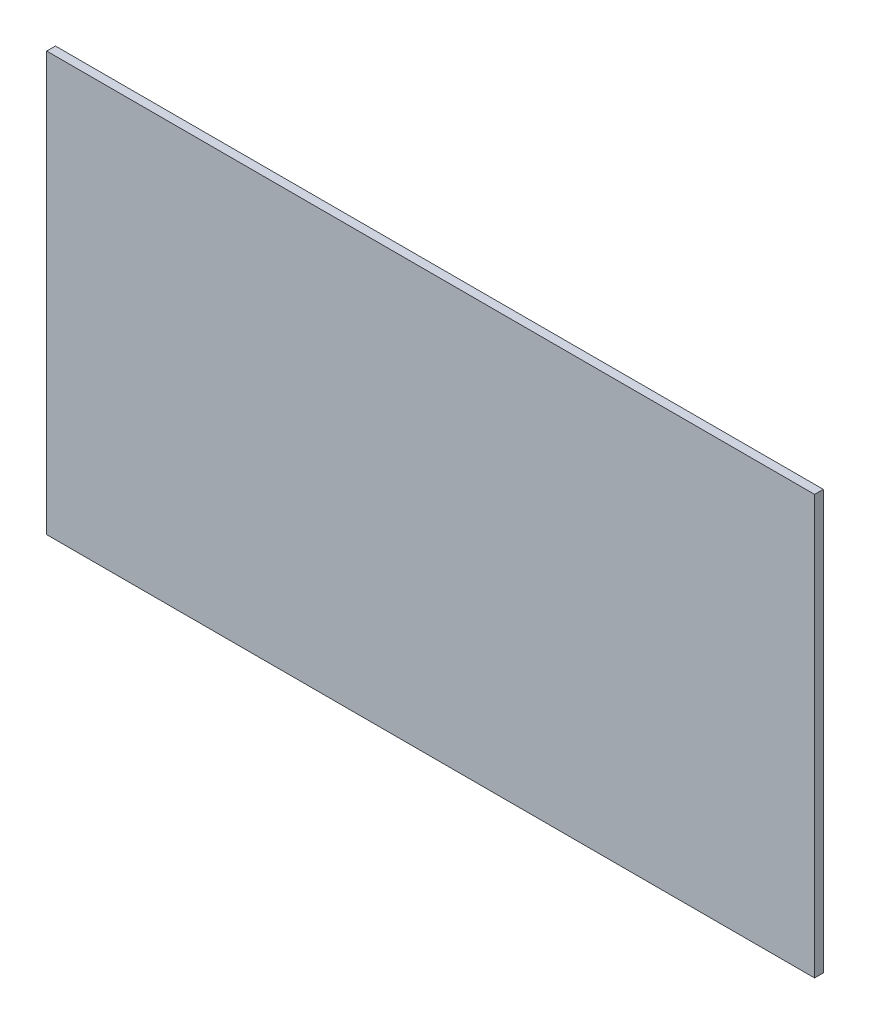
ISO-10303-21;
HEADER;
FILE_DESCRIPTION(('STEP AP214'),'2;1');
FILE_NAME('part.step','',(''),(''),'','','');
FILE_SCHEMA(('AUTOMOTIVE_DESIGN { 1 0 10303 214 1 1 1 1 }'));
ENDSEC;
DATA;
#1=APPLICATION_CONTEXT('core data for automotive mechanical design processes');
#2=APPLICATION_PROTOCOL_DEFINITION('international standard','automotive_design',2000,#1);
#3=PRODUCT_CONTEXT('',#1,'mechanical');
#4=PRODUCT('Part','Part','',(#3));
#5=PRODUCT_RELATED_PRODUCT_CATEGORY('part','',(#4));
#6=PRODUCT_DEFINITION_FORMATION('','',#4);
#7=PRODUCT_DEFINITION_CONTEXT('part definition',#1,'design');
#8=PRODUCT_DEFINITION('design','',#6,#7);
#9=PRODUCT_DEFINITION_SHAPE('','',#8);
#10=(LENGTH_UNIT() NAMED_UNIT(*) SI_UNIT(.MILLI.,.METRE.));
#11=(NAMED_UNIT(*) PLANE_ANGLE_UNIT() SI_UNIT($,.RADIAN.));
#12=(NAMED_UNIT(*) SI_UNIT($,.STERADIAN.) SOLID_ANGLE_UNIT());
#13=UNCERTAINTY_MEASURE_WITH_UNIT(LENGTH_MEASURE(1.E-05),#10,'distance_accuracy_value','');
#14=(GEOMETRIC_REPRESENTATION_CONTEXT(3) GLOBAL_UNCERTAINTY_ASSIGNED_CONTEXT((#13)) GLOBAL_UNIT_ASSIGNED_CONTEXT((#10,
#11,#12)) REPRESENTATION_CONTEXT('',''));
#15=CARTESIAN_POINT('',(0.,0.,0.));
#16=DIRECTION('',(0.,0.,1.));
#17=DIRECTION('',(1.,0.,0.));
#18=AXIS2_PLACEMENT_3D('',#15,#16,#17);
#19=CARTESIAN_POINT('',(-440.,-240.,10.));
#20=DIRECTION('',(0.,1.,0.));
#21=DIRECTION('',(-1.,0.,0.));
#22=AXIS2_PLACEMENT_3D('',#19,#20,#21);
#23=PLANE('',#22);
#24=DIRECTION('',(1.,0.,0.));
#25=VECTOR('',#24,1.);
#26=CARTESIAN_POINT('',(-440.,-240.,0.));
#27=LINE('',#26,#25);
#28=CARTESIAN_POINT('',(-440.,-240.,0.));
#29=VERTEX_POINT('',#28);
#30=CARTESIAN_POINT('',(440.,-240.,0.));
#31=VERTEX_POINT('',#30);
#32=EDGE_CURVE('E94',#29,#31,#27,.T.);
#33=ORIENTED_EDGE('',*,*,#32,.T.);
#34=DIRECTION('',(0.,0.,-1.));
#35=VECTOR('',#34,1.);
#36=CARTESIAN_POINT('',(440.,-240.,10.));
#37=LINE('',#36,#35);
#38=CARTESIAN_POINT('',(440.,-240.,10.));
#39=VERTEX_POINT('',#38);
#40=EDGE_CURVE('E11',#39,#31,#37,.T.);
#41=ORIENTED_EDGE('',*,*,#40,.F.);
#42=DIRECTION('',(1.,0.,0.));
#43=VECTOR('',#42,1.);
#44=CARTESIAN_POINT('',(-440.,-240.,10.));
#45=LINE('',#44,#43);
#46=CARTESIAN_POINT('',(-440.,-240.,10.));
#47=VERTEX_POINT('',#46);
#48=EDGE_CURVE('E82',#47,#39,#45,.T.);
#49=ORIENTED_EDGE('',*,*,#48,.F.);
#50=DIRECTION('',(0.,0.,-1.));
#51=VECTOR('',#50,1.);
#52=CARTESIAN_POINT('',(-440.,-240.,10.));
#53=LINE('',#52,#51);
#54=EDGE_CURVE('E90',#47,#29,#53,.T.);
#55=ORIENTED_EDGE('',*,*,#54,.T.);
#56=EDGE_LOOP('',(#33,#41,#49,#55));
#57=FACE_BOUND('',#56,.T.);
#58=ADVANCED_FACE('F31',(#57),#23,.F.);
#59=CARTESIAN_POINT('',(440.,-240.,10.));
#60=DIRECTION('',(-1.,0.,0.));
#61=DIRECTION('',(0.,-1.,0.));
#62=AXIS2_PLACEMENT_3D('',#59,#60,#61);
#63=PLANE('',#62);
#64=DIRECTION('',(0.,1.,0.));
#65=VECTOR('',#64,1.);
#66=CARTESIAN_POINT('',(440.,-240.,0.));
#67=LINE('',#66,#65);
#68=CARTESIAN_POINT('',(440.,240.,0.));
#69=VERTEX_POINT('',#68);
#70=EDGE_CURVE('E86',#31,#69,#67,.T.);
#71=ORIENTED_EDGE('',*,*,#70,.T.);
#72=DIRECTION('',(0.,0.,-1.));
#73=VECTOR('',#72,1.);
#74=CARTESIAN_POINT('',(440.,240.,10.));
#75=LINE('',#74,#73);
#76=CARTESIAN_POINT('',(440.,240.,10.));
#77=VERTEX_POINT('',#76);
#78=EDGE_CURVE('E39',#77,#69,#75,.T.);
#79=ORIENTED_EDGE('',*,*,#78,.F.);
#80=DIRECTION('',(0.,1.,0.));
#81=VECTOR('',#80,1.);
#82=CARTESIAN_POINT('',(440.,-240.,10.));
#83=LINE('',#82,#81);
#84=EDGE_CURVE('E77',#39,#77,#83,.T.);
#85=ORIENTED_EDGE('',*,*,#84,.F.);
#86=ORIENTED_EDGE('',*,*,#40,.T.);
#87=EDGE_LOOP('',(#71,#79,#85,#86));
#88=FACE_BOUND('',#87,.T.);
#89=ADVANCED_FACE('F85',(#88),#63,.F.);
#90=CARTESIAN_POINT('',(440.,240.,10.));
#91=DIRECTION('',(0.,-1.,0.));
#92=DIRECTION('',(0.,0.,-1.));
#93=AXIS2_PLACEMENT_3D('',#90,#91,#92);
#94=PLANE('',#93);
#95=DIRECTION('',(-1.,0.,0.));
#96=VECTOR('',#95,1.);
#97=CARTESIAN_POINT('',(440.,240.,0.));
#98=LINE('',#97,#96);
#99=CARTESIAN_POINT('',(-440.,240.,0.));
#100=VERTEX_POINT('',#99);
#101=EDGE_CURVE('E64',#69,#100,#98,.T.);
#102=ORIENTED_EDGE('',*,*,#101,.T.);
#103=DIRECTION('',(0.,0.,-1.));
#104=VECTOR('',#103,1.);
#105=CARTESIAN_POINT('',(-440.,240.,10.));
#106=LINE('',#105,#104);
#107=CARTESIAN_POINT('',(-440.,240.,10.));
#108=VERTEX_POINT('',#107);
#109=EDGE_CURVE('E87',#108,#100,#106,.T.);
#110=ORIENTED_EDGE('',*,*,#109,.F.);
#111=DIRECTION('',(-1.,0.,0.));
#112=VECTOR('',#111,1.);
#113=CARTESIAN_POINT('',(440.,240.,10.));
#114=LINE('',#113,#112);
#115=EDGE_CURVE('E80',#77,#108,#114,.T.);
#116=ORIENTED_EDGE('',*,*,#115,.F.);
#117=ORIENTED_EDGE('',*,*,#78,.T.);
#118=EDGE_LOOP('',(#102,#110,#116,#117));
#119=FACE_BOUND('',#118,.T.);
#120=ADVANCED_FACE('F88',(#119),#94,.F.);
#121=CARTESIAN_POINT('',(-440.,240.,10.));
#122=DIRECTION('',(1.,0.,0.));
#123=DIRECTION('',(0.,1.,0.));
#124=AXIS2_PLACEMENT_3D('',#121,#122,#123);
#125=PLANE('',#124);
#126=DIRECTION('',(0.,-1.,0.));
#127=VECTOR('',#126,1.);
#128=CARTESIAN_POINT('',(-440.,240.,0.));
#129=LINE('',#128,#127);
#130=EDGE_CURVE('E70',#100,#29,#129,.T.);
#131=ORIENTED_EDGE('',*,*,#130,.T.);
#132=ORIENTED_EDGE('',*,*,#54,.F.);
#133=DIRECTION('',(0.,-1.,0.));
#134=VECTOR('',#133,1.);
#135=CARTESIAN_POINT('',(-440.,240.,10.));
#136=LINE('',#135,#134);
#137=EDGE_CURVE('E47',#108,#47,#136,.T.);
#138=ORIENTED_EDGE('',*,*,#137,.F.);
#139=ORIENTED_EDGE('',*,*,#109,.T.);
#140=EDGE_LOOP('',(#131,#132,#138,#139));
#141=FACE_BOUND('',#140,.T.);
#142=ADVANCED_FACE('F101',(#141),#125,.F.);
#143=CARTESIAN_POINT('',(0.,0.,10.));
#144=DIRECTION('',(0.,0.,1.));
#145=DIRECTION('',(1.,0.,0.));
#146=AXIS2_PLACEMENT_3D('',#143,#144,#145);
#147=PLANE('',#146);
#148=ORIENTED_EDGE('',*,*,#48,.T.);
#149=ORIENTED_EDGE('',*,*,#84,.T.);
#150=ORIENTED_EDGE('',*,*,#115,.T.);
#151=ORIENTED_EDGE('',*,*,#137,.T.);
#152=EDGE_LOOP('',(#148,#149,#150,#151));
#153=FACE_BOUND('',#152,.T.);
#154=ADVANCED_FACE('F78',(#153),#147,.T.);
#155=CARTESIAN_POINT('',(0.,0.,0.));
#156=DIRECTION('',(0.,0.,1.));
#157=DIRECTION('',(1.,0.,0.));
#158=AXIS2_PLACEMENT_3D('',#155,#156,#157);
#159=PLANE('',#158);
#160=ORIENTED_EDGE('',*,*,#32,.F.);
#161=ORIENTED_EDGE('',*,*,#130,.F.);
#162=ORIENTED_EDGE('',*,*,#101,.F.);
#163=ORIENTED_EDGE('',*,*,#70,.F.);
#164=EDGE_LOOP('',(#160,#161,#162,#163));
#165=FACE_BOUND('',#164,.T.);
#166=ADVANCED_FACE('F104',(#165),#159,.F.);
#167=CLOSED_SHELL('',(#58,#89,#120,#142,#154,#166));
#168=MANIFOLD_SOLID_BREP('B2',#167);
#169=ADVANCED_BREP_SHAPE_REPRESENTATION('',(#18,#168),#14);
#170=SHAPE_DEFINITION_REPRESENTATION(#9,#169);
ENDSEC;
END-ISO-10303-21;
